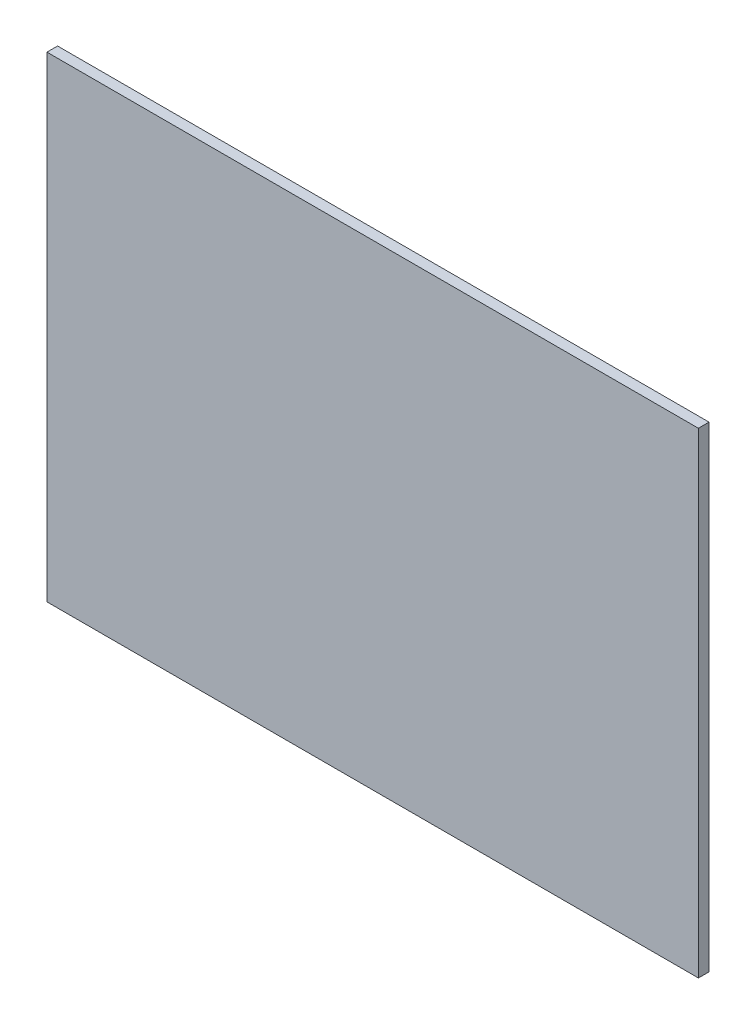
ISO-10303-21;
HEADER;
FILE_DESCRIPTION(('STEP AP214'),'2;1');
FILE_NAME('part.step','',(''),(''),'','','');
FILE_SCHEMA(('AUTOMOTIVE_DESIGN { 1 0 10303 214 1 1 1 1 }'));
ENDSEC;
DATA;
#1=APPLICATION_CONTEXT('core data for automotive mechanical design processes');
#2=APPLICATION_PROTOCOL_DEFINITION('international standard','automotive_design',2000,#1);
#3=PRODUCT_CONTEXT('',#1,'mechanical');
#4=PRODUCT('Part','Part','',(#3));
#5=PRODUCT_RELATED_PRODUCT_CATEGORY('part','',(#4));
#6=PRODUCT_DEFINITION_FORMATION('','',#4);
#7=PRODUCT_DEFINITION_CONTEXT('part definition',#1,'design');
#8=PRODUCT_DEFINITION('design','',#6,#7);
#9=PRODUCT_DEFINITION_SHAPE('','',#8);
#10=(LENGTH_UNIT() NAMED_UNIT(*) SI_UNIT(.MILLI.,.METRE.));
#11=(NAMED_UNIT(*) PLANE_ANGLE_UNIT() SI_UNIT($,.RADIAN.));
#12=(NAMED_UNIT(*) SI_UNIT($,.STERADIAN.) SOLID_ANGLE_UNIT());
#13=UNCERTAINTY_MEASURE_WITH_UNIT(LENGTH_MEASURE(1.E-05),#10,'distance_accuracy_value','');
#14=(GEOMETRIC_REPRESENTATION_CONTEXT(3) GLOBAL_UNCERTAINTY_ASSIGNED_CONTEXT((#13)) GLOBAL_UNIT_ASSIGNED_CONTEXT((#10,
#11,#12)) REPRESENTATION_CONTEXT('',''));
#15=CARTESIAN_POINT('',(0.,0.,0.));
#16=DIRECTION('',(0.,0.,1.));
#17=DIRECTION('',(1.,0.,0.));
#18=AXIS2_PLACEMENT_3D('',#15,#16,#17);
#19=CARTESIAN_POINT('',(-61.3,-44.8,2.));
#20=DIRECTION('',(1.,0.,0.));
#21=DIRECTION('',(0.,0.,-1.));
#22=AXIS2_PLACEMENT_3D('',#19,#20,#21);
#23=PLANE('',#22);
#24=DIRECTION('',(0.,-1.,0.));
#25=VECTOR('',#24,1.);
#26=CARTESIAN_POINT('',(-61.3,-44.8,0.));
#27=LINE('',#26,#25);
#28=CARTESIAN_POINT('',(-61.3,44.8,0.));
#29=VERTEX_POINT('',#28);
#30=CARTESIAN_POINT('',(-61.3,-44.8,0.));
#31=VERTEX_POINT('',#30);
#32=EDGE_CURVE('E97',#29,#31,#27,.T.);
#33=ORIENTED_EDGE('',*,*,#32,.T.);
#34=DIRECTION('',(0.,0.,-1.));
#35=VECTOR('',#34,1.);
#36=CARTESIAN_POINT('',(-61.3,-44.8,2.));
#37=LINE('',#36,#35);
#38=CARTESIAN_POINT('',(-61.3,-44.8,2.));
#39=VERTEX_POINT('',#38);
#40=EDGE_CURVE('E11',#39,#31,#37,.T.);
#41=ORIENTED_EDGE('',*,*,#40,.F.);
#42=DIRECTION('',(0.,-1.,0.));
#43=VECTOR('',#42,1.);
#44=CARTESIAN_POINT('',(-61.3,-44.8,2.));
#45=LINE('',#44,#43);
#46=CARTESIAN_POINT('',(-61.3,44.8,2.));
#47=VERTEX_POINT('',#46);
#48=EDGE_CURVE('E85',#47,#39,#45,.T.);
#49=ORIENTED_EDGE('',*,*,#48,.F.);
#50=DIRECTION('',(0.,0.,-1.));
#51=VECTOR('',#50,1.);
#52=CARTESIAN_POINT('',(-61.3,44.8,2.));
#53=LINE('',#52,#51);
#54=EDGE_CURVE('E93',#47,#29,#53,.T.);
#55=ORIENTED_EDGE('',*,*,#54,.T.);
#56=EDGE_LOOP('',(#33,#41,#49,#55));
#57=FACE_BOUND('',#56,.T.);
#58=ADVANCED_FACE('F34',(#57),#23,.F.);
#59=CARTESIAN_POINT('',(61.3,-44.8,2.));
#60=DIRECTION('',(0.,1.,0.));
#61=DIRECTION('',(-1.,0.,0.));
#62=AXIS2_PLACEMENT_3D('',#59,#60,#61);
#63=PLANE('',#62);
#64=DIRECTION('',(1.,0.,0.));
#65=VECTOR('',#64,1.);
#66=CARTESIAN_POINT('',(61.3,-44.8,0.));
#67=LINE('',#66,#65);
#68=CARTESIAN_POINT('',(61.3,-44.8,0.));
#69=VERTEX_POINT('',#68);
#70=EDGE_CURVE('E89',#31,#69,#67,.T.);
#71=ORIENTED_EDGE('',*,*,#70,.T.);
#72=DIRECTION('',(0.,0.,-1.));
#73=VECTOR('',#72,1.);
#74=CARTESIAN_POINT('',(61.3,-44.8,2.));
#75=LINE('',#74,#73);
#76=CARTESIAN_POINT('',(61.3,-44.8,2.));
#77=VERTEX_POINT('',#76);
#78=EDGE_CURVE('E42',#77,#69,#75,.T.);
#79=ORIENTED_EDGE('',*,*,#78,.F.);
#80=DIRECTION('',(1.,0.,0.));
#81=VECTOR('',#80,1.);
#82=CARTESIAN_POINT('',(61.3,-44.8,2.));
#83=LINE('',#82,#81);
#84=EDGE_CURVE('E80',#39,#77,#83,.T.);
#85=ORIENTED_EDGE('',*,*,#84,.F.);
#86=ORIENTED_EDGE('',*,*,#40,.T.);
#87=EDGE_LOOP('',(#71,#79,#85,#86));
#88=FACE_BOUND('',#87,.T.);
#89=ADVANCED_FACE('F88',(#88),#63,.F.);
#90=CARTESIAN_POINT('',(61.3,-44.8,2.));
#91=DIRECTION('',(-1.,0.,0.));
#92=DIRECTION('',(0.,0.,1.));
#93=AXIS2_PLACEMENT_3D('',#90,#91,#92);
#94=PLANE('',#93);
#95=DIRECTION('',(0.,1.,0.));
#96=VECTOR('',#95,1.);
#97=CARTESIAN_POINT('',(61.3,-44.8,0.));
#98=LINE('',#97,#96);
#99=CARTESIAN_POINT('',(61.3,44.8,0.));
#100=VERTEX_POINT('',#99);
#101=EDGE_CURVE('E67',#69,#100,#98,.T.);
#102=ORIENTED_EDGE('',*,*,#101,.T.);
#103=DIRECTION('',(0.,0.,-1.));
#104=VECTOR('',#103,1.);
#105=CARTESIAN_POINT('',(61.3,44.8,2.));
#106=LINE('',#105,#104);
#107=CARTESIAN_POINT('',(61.3,44.8,2.));
#108=VERTEX_POINT('',#107);
#109=EDGE_CURVE('E90',#108,#100,#106,.T.);
#110=ORIENTED_EDGE('',*,*,#109,.F.);
#111=DIRECTION('',(0.,1.,0.));
#112=VECTOR('',#111,1.);
#113=CARTESIAN_POINT('',(61.3,-44.8,2.));
#114=LINE('',#113,#112);
#115=EDGE_CURVE('E83',#77,#108,#114,.T.);
#116=ORIENTED_EDGE('',*,*,#115,.F.);
#117=ORIENTED_EDGE('',*,*,#78,.T.);
#118=EDGE_LOOP('',(#102,#110,#116,#117));
#119=FACE_BOUND('',#118,.T.);
#120=ADVANCED_FACE('F91',(#119),#94,.F.);
#121=CARTESIAN_POINT('',(61.3,44.8,2.));
#122=DIRECTION('',(0.,-1.,0.));
#123=DIRECTION('',(1.,0.,0.));
#124=AXIS2_PLACEMENT_3D('',#121,#122,#123);
#125=PLANE('',#124);
#126=DIRECTION('',(-1.,0.,0.));
#127=VECTOR('',#126,1.);
#128=CARTESIAN_POINT('',(61.3,44.8,0.));
#129=LINE('',#128,#127);
#130=EDGE_CURVE('E73',#100,#29,#129,.T.);
#131=ORIENTED_EDGE('',*,*,#130,.T.);
#132=ORIENTED_EDGE('',*,*,#54,.F.);
#133=DIRECTION('',(-1.,0.,0.));
#134=VECTOR('',#133,1.);
#135=CARTESIAN_POINT('',(61.3,44.8,2.));
#136=LINE('',#135,#134);
#137=EDGE_CURVE('E50',#108,#47,#136,.T.);
#138=ORIENTED_EDGE('',*,*,#137,.F.);
#139=ORIENTED_EDGE('',*,*,#109,.T.);
#140=EDGE_LOOP('',(#131,#132,#138,#139));
#141=FACE_BOUND('',#140,.T.);
#142=ADVANCED_FACE('F104',(#141),#125,.F.);
#143=CARTESIAN_POINT('',(0.,0.,2.));
#144=DIRECTION('',(0.,0.,1.));
#145=DIRECTION('',(1.,0.,0.));
#146=AXIS2_PLACEMENT_3D('',#143,#144,#145);
#147=PLANE('',#146);
#148=ORIENTED_EDGE('',*,*,#48,.T.);
#149=ORIENTED_EDGE('',*,*,#84,.T.);
#150=ORIENTED_EDGE('',*,*,#115,.T.);
#151=ORIENTED_EDGE('',*,*,#137,.T.);
#152=EDGE_LOOP('',(#148,#149,#150,#151));
#153=FACE_BOUND('',#152,.T.);
#154=ADVANCED_FACE('F81',(#153),#147,.T.);
#155=CARTESIAN_POINT('',(0.,0.,0.));
#156=DIRECTION('',(0.,0.,1.));
#157=DIRECTION('',(1.,0.,0.));
#158=AXIS2_PLACEMENT_3D('',#155,#156,#157);
#159=PLANE('',#158);
#160=ORIENTED_EDGE('',*,*,#32,.F.);
#161=ORIENTED_EDGE('',*,*,#130,.F.);
#162=ORIENTED_EDGE('',*,*,#101,.F.);
#163=ORIENTED_EDGE('',*,*,#70,.F.);
#164=EDGE_LOOP('',(#160,#161,#162,#163));
#165=FACE_BOUND('',#164,.T.);
#166=ADVANCED_FACE('F107',(#165),#159,.F.);
#167=CLOSED_SHELL('',(#58,#89,#120,#142,#154,#166));
#168=MANIFOLD_SOLID_BREP('B2',#167);
#169=ADVANCED_BREP_SHAPE_REPRESENTATION('',(#18,#168),#14);
#170=SHAPE_DEFINITION_REPRESENTATION(#9,#169);
ENDSEC;
END-ISO-10303-21;
